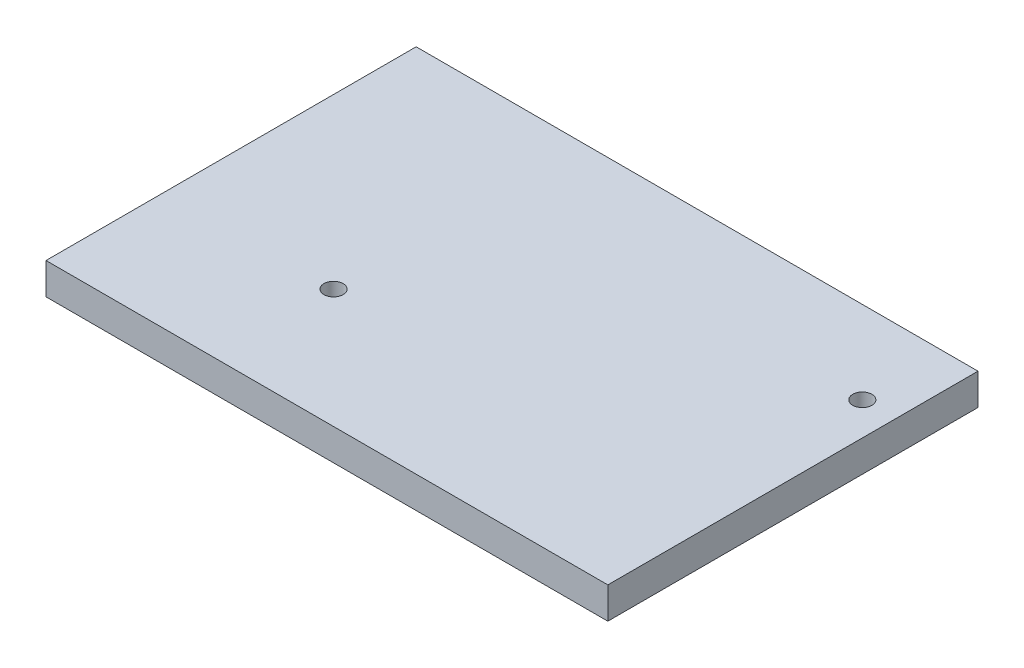
ISO-10303-21;
HEADER;
FILE_DESCRIPTION(('STEP AP214'),'2;1');
FILE_NAME('part.step','',(''),(''),'','','');
FILE_SCHEMA(('AUTOMOTIVE_DESIGN { 1 0 10303 214 1 1 1 1 }'));
ENDSEC;
DATA;
#1=APPLICATION_CONTEXT('core data for automotive mechanical design processes');
#2=APPLICATION_PROTOCOL_DEFINITION('international standard','automotive_design',2000,#1);
#3=PRODUCT_CONTEXT('',#1,'mechanical');
#4=PRODUCT('Part','Part','',(#3));
#5=PRODUCT_RELATED_PRODUCT_CATEGORY('part','',(#4));
#6=PRODUCT_DEFINITION_FORMATION('','',#4);
#7=PRODUCT_DEFINITION_CONTEXT('part definition',#1,'design');
#8=PRODUCT_DEFINITION('design','',#6,#7);
#9=PRODUCT_DEFINITION_SHAPE('','',#8);
#10=(LENGTH_UNIT() NAMED_UNIT(*) SI_UNIT(.MILLI.,.METRE.));
#11=(NAMED_UNIT(*) PLANE_ANGLE_UNIT() SI_UNIT($,.RADIAN.));
#12=(NAMED_UNIT(*) SI_UNIT($,.STERADIAN.) SOLID_ANGLE_UNIT());
#13=UNCERTAINTY_MEASURE_WITH_UNIT(LENGTH_MEASURE(1.E-05),#10,'distance_accuracy_value','');
#14=(GEOMETRIC_REPRESENTATION_CONTEXT(3) GLOBAL_UNCERTAINTY_ASSIGNED_CONTEXT((#13)) GLOBAL_UNIT_ASSIGNED_CONTEXT((#10,
#11,#12)) REPRESENTATION_CONTEXT('',''));
#15=CARTESIAN_POINT('',(0.,0.,0.));
#16=DIRECTION('',(0.,0.,1.));
#17=DIRECTION('',(1.,0.,0.));
#18=AXIS2_PLACEMENT_3D('',#15,#16,#17);
#19=CARTESIAN_POINT('',(-42.5,4.7625,28.));
#20=DIRECTION('',(1.,0.,0.));
#21=DIRECTION('',(0.,0.,-1.));
#22=AXIS2_PLACEMENT_3D('',#19,#20,#21);
#23=PLANE('',#22);
#24=DIRECTION('',(0.,0.,1.));
#25=VECTOR('',#24,1.);
#26=CARTESIAN_POINT('',(-42.5,0.,28.));
#27=LINE('',#26,#25);
#28=CARTESIAN_POINT('',(-42.5,0.,-28.));
#29=VERTEX_POINT('',#28);
#30=CARTESIAN_POINT('',(-42.5,0.,28.));
#31=VERTEX_POINT('',#30);
#32=EDGE_CURVE('E96',#29,#31,#27,.T.);
#33=ORIENTED_EDGE('',*,*,#32,.T.);
#34=DIRECTION('',(0.,-1.,0.));
#35=VECTOR('',#34,1.);
#36=CARTESIAN_POINT('',(-42.5,4.7625,28.));
#37=LINE('',#36,#35);
#38=CARTESIAN_POINT('',(-42.5,4.7625,28.));
#39=VERTEX_POINT('',#38);
#40=EDGE_CURVE('E11',#39,#31,#37,.T.);
#41=ORIENTED_EDGE('',*,*,#40,.F.);
#42=DIRECTION('',(0.,0.,1.));
#43=VECTOR('',#42,1.);
#44=CARTESIAN_POINT('',(-42.5,4.7625,28.));
#45=LINE('',#44,#43);
#46=CARTESIAN_POINT('',(-42.5,4.7625,-28.));
#47=VERTEX_POINT('',#46);
#48=EDGE_CURVE('E84',#47,#39,#45,.T.);
#49=ORIENTED_EDGE('',*,*,#48,.F.);
#50=DIRECTION('',(0.,-1.,0.));
#51=VECTOR('',#50,1.);
#52=CARTESIAN_POINT('',(-42.5,4.7625,-28.));
#53=LINE('',#52,#51);
#54=EDGE_CURVE('E92',#47,#29,#53,.T.);
#55=ORIENTED_EDGE('',*,*,#54,.T.);
#56=EDGE_LOOP('',(#33,#41,#49,#55));
#57=FACE_BOUND('',#56,.T.);
#58=ADVANCED_FACE('F33',(#57),#23,.F.);
#59=CARTESIAN_POINT('',(-42.5,4.7625,28.));
#60=DIRECTION('',(0.,0.,-1.));
#61=DIRECTION('',(-1.,0.,0.));
#62=AXIS2_PLACEMENT_3D('',#59,#60,#61);
#63=PLANE('',#62);
#64=DIRECTION('',(1.,0.,0.));
#65=VECTOR('',#64,1.);
#66=CARTESIAN_POINT('',(-42.5,0.,28.));
#67=LINE('',#66,#65);
#68=CARTESIAN_POINT('',(42.5,0.,28.));
#69=VERTEX_POINT('',#68);
#70=EDGE_CURVE('E88',#31,#69,#67,.T.);
#71=ORIENTED_EDGE('',*,*,#70,.T.);
#72=DIRECTION('',(0.,-1.,0.));
#73=VECTOR('',#72,1.);
#74=CARTESIAN_POINT('',(42.5,4.7625,28.));
#75=LINE('',#74,#73);
#76=CARTESIAN_POINT('',(42.5,4.7625,28.));
#77=VERTEX_POINT('',#76);
#78=EDGE_CURVE('E41',#77,#69,#75,.T.);
#79=ORIENTED_EDGE('',*,*,#78,.F.);
#80=DIRECTION('',(1.,0.,0.));
#81=VECTOR('',#80,1.);
#82=CARTESIAN_POINT('',(-42.5,4.7625,28.));
#83=LINE('',#82,#81);
#84=EDGE_CURVE('E79',#39,#77,#83,.T.);
#85=ORIENTED_EDGE('',*,*,#84,.F.);
#86=ORIENTED_EDGE('',*,*,#40,.T.);
#87=EDGE_LOOP('',(#71,#79,#85,#86));
#88=FACE_BOUND('',#87,.T.);
#89=ADVANCED_FACE('F87',(#88),#63,.F.);
#90=CARTESIAN_POINT('',(42.5,4.7625,28.));
#91=DIRECTION('',(-1.,0.,0.));
#92=DIRECTION('',(0.,0.,1.));
#93=AXIS2_PLACEMENT_3D('',#90,#91,#92);
#94=PLANE('',#93);
#95=DIRECTION('',(0.,0.,-1.));
#96=VECTOR('',#95,1.);
#97=CARTESIAN_POINT('',(42.5,0.,28.));
#98=LINE('',#97,#96);
#99=CARTESIAN_POINT('',(42.5,0.,-28.));
#100=VERTEX_POINT('',#99);
#101=EDGE_CURVE('E66',#69,#100,#98,.T.);
#102=ORIENTED_EDGE('',*,*,#101,.T.);
#103=DIRECTION('',(0.,-1.,0.));
#104=VECTOR('',#103,1.);
#105=CARTESIAN_POINT('',(42.5,4.7625,-28.));
#106=LINE('',#105,#104);
#107=CARTESIAN_POINT('',(42.5,4.7625,-28.));
#108=VERTEX_POINT('',#107);
#109=EDGE_CURVE('E89',#108,#100,#106,.T.);
#110=ORIENTED_EDGE('',*,*,#109,.F.);
#111=DIRECTION('',(0.,0.,-1.));
#112=VECTOR('',#111,1.);
#113=CARTESIAN_POINT('',(42.5,4.7625,28.));
#114=LINE('',#113,#112);
#115=EDGE_CURVE('E82',#77,#108,#114,.T.);
#116=ORIENTED_EDGE('',*,*,#115,.F.);
#117=ORIENTED_EDGE('',*,*,#78,.T.);
#118=EDGE_LOOP('',(#102,#110,#116,#117));
#119=FACE_BOUND('',#118,.T.);
#120=ADVANCED_FACE('F90',(#119),#94,.F.);
#121=CARTESIAN_POINT('',(-42.5,4.7625,-28.));
#122=DIRECTION('',(0.,0.,1.));
#123=DIRECTION('',(1.,0.,0.));
#124=AXIS2_PLACEMENT_3D('',#121,#122,#123);
#125=PLANE('',#124);
#126=DIRECTION('',(-1.,0.,0.));
#127=VECTOR('',#126,1.);
#128=CARTESIAN_POINT('',(-42.5,0.,-28.));
#129=LINE('',#128,#127);
#130=EDGE_CURVE('E72',#100,#29,#129,.T.);
#131=ORIENTED_EDGE('',*,*,#130,.T.);
#132=ORIENTED_EDGE('',*,*,#54,.F.);
#133=DIRECTION('',(-1.,0.,0.));
#134=VECTOR('',#133,1.);
#135=CARTESIAN_POINT('',(-42.5,4.7625,-28.));
#136=LINE('',#135,#134);
#137=EDGE_CURVE('E49',#108,#47,#136,.T.);
#138=ORIENTED_EDGE('',*,*,#137,.F.);
#139=ORIENTED_EDGE('',*,*,#109,.T.);
#140=EDGE_LOOP('',(#131,#132,#138,#139));
#141=FACE_BOUND('',#140,.T.);
#142=ADVANCED_FACE('F104',(#141),#125,.F.);
#143=CARTESIAN_POINT('',(0.,4.7625,0.));
#144=DIRECTION('',(0.,-1.,0.));
#145=DIRECTION('',(0.,0.,-1.));
#146=AXIS2_PLACEMENT_3D('',#143,#144,#145);
#147=PLANE('',#146);
#148=CARTESIAN_POINT('',(-17.,4.7625,10.));
#149=DIRECTION('',(0.,-1.,0.));
#150=DIRECTION('',(0.,0.,-1.));
#151=AXIS2_PLACEMENT_3D('',#148,#149,#150);
#152=CIRCLE('',#151,1.45);
#153=CARTESIAN_POINT('',(-17.,4.7625,8.55));
#154=VERTEX_POINT('',#153);
#155=EDGE_CURVE('E118',#154,#154,#152,.T.);
#156=ORIENTED_EDGE('',*,*,#155,.T.);
#157=EDGE_LOOP('',(#156));
#158=FACE_BOUND('',#157,.T.);
#159=CARTESIAN_POINT('',(37.5,4.7625,-15.5));
#160=DIRECTION('',(0.,-1.,0.));
#161=DIRECTION('',(0.,0.,-1.));
#162=AXIS2_PLACEMENT_3D('',#159,#160,#161);
#163=CIRCLE('',#162,1.45);
#164=CARTESIAN_POINT('',(37.5,4.7625,-16.95));
#165=VERTEX_POINT('',#164);
#166=EDGE_CURVE('E99',#165,#165,#163,.T.);
#167=ORIENTED_EDGE('',*,*,#166,.T.);
#168=EDGE_LOOP('',(#167));
#169=FACE_BOUND('',#168,.T.);
#170=ORIENTED_EDGE('',*,*,#48,.T.);
#171=ORIENTED_EDGE('',*,*,#84,.T.);
#172=ORIENTED_EDGE('',*,*,#115,.T.);
#173=ORIENTED_EDGE('',*,*,#137,.T.);
#174=EDGE_LOOP('',(#170,#171,#172,#173));
#175=FACE_BOUND('',#174,.T.);
#176=ADVANCED_FACE('F80',(#158,#169,#175),#147,.F.);
#177=CARTESIAN_POINT('',(0.,0.,0.));
#178=DIRECTION('',(0.,-1.,0.));
#179=DIRECTION('',(0.,0.,-1.));
#180=AXIS2_PLACEMENT_3D('',#177,#178,#179);
#181=PLANE('',#180);
#182=CARTESIAN_POINT('',(-17.,0.,10.));
#183=DIRECTION('',(0.,-1.,0.));
#184=DIRECTION('',(0.,0.,-1.));
#185=AXIS2_PLACEMENT_3D('',#182,#183,#184);
#186=CIRCLE('',#185,3.75);
#187=CARTESIAN_POINT('',(-17.,0.,6.25));
#188=VERTEX_POINT('',#187);
#189=EDGE_CURVE('E124',#188,#188,#186,.T.);
#190=ORIENTED_EDGE('',*,*,#189,.F.);
#191=EDGE_LOOP('',(#190));
#192=FACE_BOUND('',#191,.T.);
#193=CARTESIAN_POINT('',(37.5,0.,-15.5));
#194=DIRECTION('',(0.,-1.,0.));
#195=DIRECTION('',(0.,0.,-1.));
#196=AXIS2_PLACEMENT_3D('',#193,#194,#195);
#197=CIRCLE('',#196,3.75);
#198=CARTESIAN_POINT('',(37.5,0.,-19.25));
#199=VERTEX_POINT('',#198);
#200=EDGE_CURVE('E115',#199,#199,#197,.T.);
#201=ORIENTED_EDGE('',*,*,#200,.F.);
#202=EDGE_LOOP('',(#201));
#203=FACE_BOUND('',#202,.T.);
#204=ORIENTED_EDGE('',*,*,#32,.F.);
#205=ORIENTED_EDGE('',*,*,#130,.F.);
#206=ORIENTED_EDGE('',*,*,#101,.F.);
#207=ORIENTED_EDGE('',*,*,#70,.F.);
#208=EDGE_LOOP('',(#204,#205,#206,#207));
#209=FACE_BOUND('',#208,.T.);
#210=ADVANCED_FACE('F107',(#192,#203,#209),#181,.T.);
#211=CARTESIAN_POINT('',(37.5,0.,-15.5));
#212=DIRECTION('',(0.,-1.,0.));
#213=DIRECTION('',(0.,0.,-1.));
#214=AXIS2_PLACEMENT_3D('',#211,#212,#213);
#215=CYLINDRICAL_SURFACE('',#214,1.45);
#216=ORIENTED_EDGE('',*,*,#166,.F.);
#217=EDGE_LOOP('',(#216));
#218=FACE_BOUND('',#217,.T.);
#219=CARTESIAN_POINT('',(37.5,2.3,-15.5));
#220=DIRECTION('',(0.,-1.,0.));
#221=DIRECTION('',(0.,0.,-1.));
#222=AXIS2_PLACEMENT_3D('',#219,#220,#221);
#223=CIRCLE('',#222,1.45);
#224=CARTESIAN_POINT('',(37.5,2.3,-16.95));
#225=VERTEX_POINT('',#224);
#226=EDGE_CURVE('E112',#225,#225,#223,.T.);
#227=ORIENTED_EDGE('',*,*,#226,.T.);
#228=EDGE_LOOP('',(#227));
#229=FACE_BOUND('',#228,.T.);
#230=ADVANCED_FACE('F132',(#218,#229),#215,.F.);
#231=CARTESIAN_POINT('',(37.5,0.,-15.5));
#232=DIRECTION('',(0.,-1.,0.));
#233=DIRECTION('',(0.,0.,-1.));
#234=AXIS2_PLACEMENT_3D('',#231,#232,#233);
#235=CONICAL_SURFACE('',#234,3.75,0.785398163397448);
#236=ORIENTED_EDGE('',*,*,#226,.F.);
#237=EDGE_LOOP('',(#236));
#238=FACE_BOUND('',#237,.T.);
#239=ORIENTED_EDGE('',*,*,#200,.T.);
#240=EDGE_LOOP('',(#239));
#241=FACE_BOUND('',#240,.T.);
#242=ADVANCED_FACE('F136',(#238,#241),#235,.F.);
#243=CARTESIAN_POINT('',(-17.,0.,10.));
#244=DIRECTION('',(0.,-1.,0.));
#245=DIRECTION('',(0.,0.,-1.));
#246=AXIS2_PLACEMENT_3D('',#243,#244,#245);
#247=CYLINDRICAL_SURFACE('',#246,1.45);
#248=ORIENTED_EDGE('',*,*,#155,.F.);
#249=EDGE_LOOP('',(#248));
#250=FACE_BOUND('',#249,.T.);
#251=CARTESIAN_POINT('',(-17.,2.3,10.));
#252=DIRECTION('',(0.,-1.,0.));
#253=DIRECTION('',(0.,0.,-1.));
#254=AXIS2_PLACEMENT_3D('',#251,#252,#253);
#255=CIRCLE('',#254,1.45);
#256=CARTESIAN_POINT('',(-17.,2.3,8.55));
#257=VERTEX_POINT('',#256);
#258=EDGE_CURVE('E121',#257,#257,#255,.T.);
#259=ORIENTED_EDGE('',*,*,#258,.T.);
#260=EDGE_LOOP('',(#259));
#261=FACE_BOUND('',#260,.T.);
#262=ADVANCED_FACE('F138',(#250,#261),#247,.F.);
#263=CARTESIAN_POINT('',(-17.,0.,10.));
#264=DIRECTION('',(0.,-1.,0.));
#265=DIRECTION('',(0.,0.,-1.));
#266=AXIS2_PLACEMENT_3D('',#263,#264,#265);
#267=CONICAL_SURFACE('',#266,3.75,0.785398163397449);
#268=ORIENTED_EDGE('',*,*,#258,.F.);
#269=EDGE_LOOP('',(#268));
#270=FACE_BOUND('',#269,.T.);
#271=ORIENTED_EDGE('',*,*,#189,.T.);
#272=EDGE_LOOP('',(#271));
#273=FACE_BOUND('',#272,.T.);
#274=ADVANCED_FACE('F128',(#270,#273),#267,.F.);
#275=CLOSED_SHELL('',(#58,#89,#120,#142,#176,#210,#230,#242,#262,#274));
#276=MANIFOLD_SOLID_BREP('B2',#275);
#277=ADVANCED_BREP_SHAPE_REPRESENTATION('',(#18,#276),#14);
#278=SHAPE_DEFINITION_REPRESENTATION(#9,#277);
ENDSEC;
END-ISO-10303-21;
